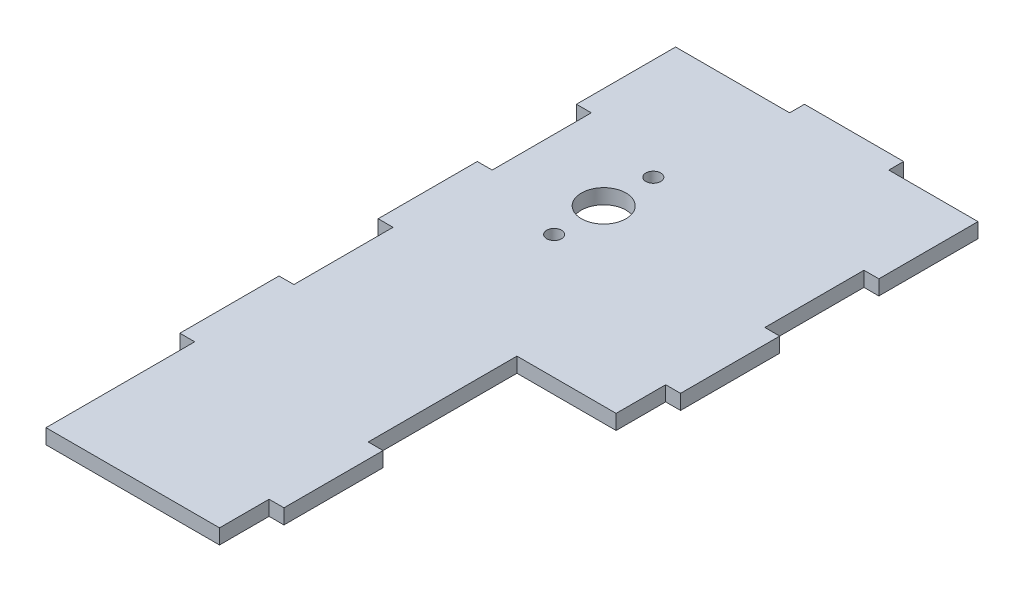
ISO-10303-21;
HEADER;
FILE_DESCRIPTION(('STEP AP214'),'2;1');
FILE_NAME('part.step','',(''),(''),'','','');
FILE_SCHEMA(('AUTOMOTIVE_DESIGN { 1 0 10303 214 1 1 1 1 }'));
ENDSEC;
DATA;
#1=APPLICATION_CONTEXT('core data for automotive mechanical design processes');
#2=APPLICATION_PROTOCOL_DEFINITION('international standard','automotive_design',2000,#1);
#3=PRODUCT_CONTEXT('',#1,'mechanical');
#4=PRODUCT('Part','Part','',(#3));
#5=PRODUCT_RELATED_PRODUCT_CATEGORY('part','',(#4));
#6=PRODUCT_DEFINITION_FORMATION('','',#4);
#7=PRODUCT_DEFINITION_CONTEXT('part definition',#1,'design');
#8=PRODUCT_DEFINITION('design','',#6,#7);
#9=PRODUCT_DEFINITION_SHAPE('','',#8);
#10=(LENGTH_UNIT() NAMED_UNIT(*) SI_UNIT(.MILLI.,.METRE.));
#11=(NAMED_UNIT(*) PLANE_ANGLE_UNIT() SI_UNIT($,.RADIAN.));
#12=(NAMED_UNIT(*) SI_UNIT($,.STERADIAN.) SOLID_ANGLE_UNIT());
#13=UNCERTAINTY_MEASURE_WITH_UNIT(LENGTH_MEASURE(1.E-05),#10,'distance_accuracy_value','');
#14=(GEOMETRIC_REPRESENTATION_CONTEXT(3) GLOBAL_UNCERTAINTY_ASSIGNED_CONTEXT((#13)) GLOBAL_UNIT_ASSIGNED_CONTEXT((#10,
#11,#12)) REPRESENTATION_CONTEXT('',''));
#15=CARTESIAN_POINT('',(0.,0.,0.));
#16=DIRECTION('',(0.,0.,1.));
#17=DIRECTION('',(1.,0.,0.));
#18=AXIS2_PLACEMENT_3D('',#15,#16,#17);
#19=CARTESIAN_POINT('',(0.,3.,0.));
#20=DIRECTION('',(1.,0.,0.));
#21=DIRECTION('',(0.,0.,-1.));
#22=AXIS2_PLACEMENT_3D('',#19,#20,#21);
#23=PLANE('',#22);
#24=DIRECTION('',(0.,0.,1.));
#25=VECTOR('',#24,1.);
#26=CARTESIAN_POINT('',(0.,3.,0.));
#27=LINE('',#26,#25);
#28=CARTESIAN_POINT('',(0.,3.,30.));
#29=VERTEX_POINT('',#28);
#30=CARTESIAN_POINT('',(0.,3.,60.));
#31=VERTEX_POINT('',#30);
#32=EDGE_CURVE('E66',#29,#31,#27,.T.);
#33=ORIENTED_EDGE('',*,*,#32,.F.);
#34=DIRECTION('',(0.,1.,0.));
#35=VECTOR('',#34,1.);
#36=CARTESIAN_POINT('',(0.,0.,30.));
#37=LINE('',#36,#35);
#38=CARTESIAN_POINT('',(0.,0.,30.));
#39=VERTEX_POINT('',#38);
#40=EDGE_CURVE('E262',#39,#29,#37,.T.);
#41=ORIENTED_EDGE('',*,*,#40,.F.);
#42=DIRECTION('',(0.,0.,1.));
#43=VECTOR('',#42,1.);
#44=CARTESIAN_POINT('',(0.,0.,0.));
#45=LINE('',#44,#43);
#46=CARTESIAN_POINT('',(0.,0.,60.));
#47=VERTEX_POINT('',#46);
#48=EDGE_CURVE('E469',#39,#47,#45,.T.);
#49=ORIENTED_EDGE('',*,*,#48,.T.);
#50=DIRECTION('',(0.,1.,0.));
#51=VECTOR('',#50,1.);
#52=CARTESIAN_POINT('',(0.,0.,60.));
#53=LINE('',#52,#51);
#54=EDGE_CURVE('E549',#47,#31,#53,.T.);
#55=ORIENTED_EDGE('',*,*,#54,.T.);
#56=EDGE_LOOP('',(#33,#41,#49,#55));
#57=FACE_BOUND('',#56,.T.);
#58=ADVANCED_FACE('F48',(#57),#23,.F.);
#59=CARTESIAN_POINT('',(35.,3.,0.));
#60=DIRECTION('',(-1.,0.,0.));
#61=DIRECTION('',(0.,0.,1.));
#62=AXIS2_PLACEMENT_3D('',#59,#60,#61);
#63=PLANE('',#62);
#64=DIRECTION('',(0.,0.,-1.));
#65=VECTOR('',#64,1.);
#66=CARTESIAN_POINT('',(35.,3.,0.));
#67=LINE('',#66,#65);
#68=CARTESIAN_POINT('',(35.,3.,30.));
#69=VERTEX_POINT('',#68);
#70=CARTESIAN_POINT('',(35.,3.,0.));
#71=VERTEX_POINT('',#70);
#72=EDGE_CURVE('E297',#69,#71,#67,.T.);
#73=ORIENTED_EDGE('',*,*,#72,.F.);
#74=DIRECTION('',(0.,1.,0.));
#75=VECTOR('',#74,1.);
#76=CARTESIAN_POINT('',(35.,0.,30.));
#77=LINE('',#76,#75);
#78=CARTESIAN_POINT('',(35.,0.,30.));
#79=VERTEX_POINT('',#78);
#80=EDGE_CURVE('E351',#79,#69,#77,.T.);
#81=ORIENTED_EDGE('',*,*,#80,.F.);
#82=DIRECTION('',(0.,0.,-1.));
#83=VECTOR('',#82,1.);
#84=CARTESIAN_POINT('',(35.,0.,0.));
#85=LINE('',#84,#83);
#86=CARTESIAN_POINT('',(35.,0.,0.));
#87=VERTEX_POINT('',#86);
#88=EDGE_CURVE('E478',#79,#87,#85,.T.);
#89=ORIENTED_EDGE('',*,*,#88,.T.);
#90=DIRECTION('',(0.,1.,0.));
#91=VECTOR('',#90,1.);
#92=CARTESIAN_POINT('',(35.,0.,0.));
#93=LINE('',#92,#91);
#94=EDGE_CURVE('E526',#87,#71,#93,.T.);
#95=ORIENTED_EDGE('',*,*,#94,.T.);
#96=EDGE_LOOP('',(#73,#81,#89,#95));
#97=FACE_BOUND('',#96,.T.);
#98=ADVANCED_FACE('F534',(#97),#63,.F.);
#99=CARTESIAN_POINT('',(0.,3.,-70.));
#100=DIRECTION('',(0.,0.,1.));
#101=DIRECTION('',(1.,0.,0.));
#102=AXIS2_PLACEMENT_3D('',#99,#100,#101);
#103=PLANE('',#102);
#104=DIRECTION('',(0.,1.,0.));
#105=VECTOR('',#104,1.);
#106=CARTESIAN_POINT('',(20.,0.,-70.));
#107=LINE('',#106,#105);
#108=CARTESIAN_POINT('',(20.,0.,-70.));
#109=VERTEX_POINT('',#108);
#110=CARTESIAN_POINT('',(20.,3.,-70.));
#111=VERTEX_POINT('',#110);
#112=EDGE_CURVE('E376',#109,#111,#107,.T.);
#113=ORIENTED_EDGE('',*,*,#112,.F.);
#114=DIRECTION('',(-1.,0.,0.));
#115=VECTOR('',#114,1.);
#116=CARTESIAN_POINT('',(0.,0.,-70.));
#117=LINE('',#116,#115);
#118=CARTESIAN_POINT('',(-3.,0.,-70.));
#119=VERTEX_POINT('',#118);
#120=EDGE_CURVE('E488',#109,#119,#117,.T.);
#121=ORIENTED_EDGE('',*,*,#120,.T.);
#122=DIRECTION('',(0.,-1.,0.));
#123=VECTOR('',#122,1.);
#124=CARTESIAN_POINT('',(-3.,3.,-70.));
#125=LINE('',#124,#123);
#126=CARTESIAN_POINT('',(-3.,3.,-70.));
#127=VERTEX_POINT('',#126);
#128=EDGE_CURVE('E445',#127,#119,#125,.T.);
#129=ORIENTED_EDGE('',*,*,#128,.F.);
#130=DIRECTION('',(-1.,0.,0.));
#131=VECTOR('',#130,1.);
#132=CARTESIAN_POINT('',(0.,3.,-70.));
#133=LINE('',#132,#131);
#134=EDGE_CURVE('E58',#111,#127,#133,.T.);
#135=ORIENTED_EDGE('',*,*,#134,.F.);
#136=EDGE_LOOP('',(#113,#121,#129,#135));
#137=FACE_BOUND('',#136,.T.);
#138=ADVANCED_FACE('F502',(#137),#103,.F.);
#139=CARTESIAN_POINT('',(55.,0.,-70.));
#140=DIRECTION('',(1.,0.,0.));
#141=DIRECTION('',(0.,0.,-1.));
#142=AXIS2_PLACEMENT_3D('',#139,#140,#141);
#143=PLANE('',#142);
#144=DIRECTION('',(0.,1.,0.));
#145=VECTOR('',#144,1.);
#146=CARTESIAN_POINT('',(55.,0.,-30.));
#147=LINE('',#146,#145);
#148=CARTESIAN_POINT('',(55.,0.,-30.));
#149=VERTEX_POINT('',#148);
#150=CARTESIAN_POINT('',(55.,3.,-30.));
#151=VERTEX_POINT('',#150);
#152=EDGE_CURVE('E676',#149,#151,#147,.T.);
#153=ORIENTED_EDGE('',*,*,#152,.F.);
#154=DIRECTION('',(0.,0.,-1.));
#155=VECTOR('',#154,1.);
#156=CARTESIAN_POINT('',(55.,0.,-70.));
#157=LINE('',#156,#155);
#158=CARTESIAN_POINT('',(55.,0.,-50.));
#159=VERTEX_POINT('',#158);
#160=EDGE_CURVE('E542',#149,#159,#157,.T.);
#161=ORIENTED_EDGE('',*,*,#160,.T.);
#162=DIRECTION('',(0.,1.,0.));
#163=VECTOR('',#162,1.);
#164=CARTESIAN_POINT('',(55.,0.,-50.));
#165=LINE('',#164,#163);
#166=CARTESIAN_POINT('',(55.,3.,-50.));
#167=VERTEX_POINT('',#166);
#168=EDGE_CURVE('E728',#159,#167,#165,.T.);
#169=ORIENTED_EDGE('',*,*,#168,.T.);
#170=DIRECTION('',(0.,0.,-1.));
#171=VECTOR('',#170,1.);
#172=CARTESIAN_POINT('',(55.,3.,-70.));
#173=LINE('',#172,#171);
#174=EDGE_CURVE('E531',#151,#167,#173,.T.);
#175=ORIENTED_EDGE('',*,*,#174,.F.);
#176=EDGE_LOOP('',(#153,#161,#169,#175));
#177=FACE_BOUND('',#176,.T.);
#178=ADVANCED_FACE('F628',(#177),#143,.T.);
#179=DIRECTION('',(0.,1.,0.));
#180=VECTOR('',#179,1.);
#181=CARTESIAN_POINT('',(55.,0.,-10.));
#182=LINE('',#181,#180);
#183=CARTESIAN_POINT('',(55.,0.,-10.));
#184=VERTEX_POINT('',#183);
#185=CARTESIAN_POINT('',(55.,3.,-10.));
#186=VERTEX_POINT('',#185);
#187=EDGE_CURVE('E686',#184,#186,#182,.T.);
#188=ORIENTED_EDGE('',*,*,#187,.T.);
#189=CARTESIAN_POINT('',(55.,3.,0.));
#190=VERTEX_POINT('',#189);
#191=EDGE_CURVE('E740',#190,#186,#173,.T.);
#192=ORIENTED_EDGE('',*,*,#191,.F.);
#193=DIRECTION('',(0.,1.,0.));
#194=VECTOR('',#193,1.);
#195=CARTESIAN_POINT('',(55.,0.,0.));
#196=LINE('',#195,#194);
#197=CARTESIAN_POINT('',(55.,0.,0.));
#198=VERTEX_POINT('',#197);
#199=EDGE_CURVE('E528',#198,#190,#196,.T.);
#200=ORIENTED_EDGE('',*,*,#199,.F.);
#201=EDGE_CURVE('E536',#198,#184,#157,.T.);
#202=ORIENTED_EDGE('',*,*,#201,.T.);
#203=EDGE_LOOP('',(#188,#192,#200,#202));
#204=FACE_BOUND('',#203,.T.);
#205=ADVANCED_FACE('F622',(#204),#143,.T.);
#206=DIRECTION('',(0.,-1.,0.));
#207=VECTOR('',#206,1.);
#208=CARTESIAN_POINT('',(0.,3.,-30.));
#209=LINE('',#208,#207);
#210=CARTESIAN_POINT('',(0.,3.,-30.));
#211=VERTEX_POINT('',#210);
#212=CARTESIAN_POINT('',(0.,0.,-30.));
#213=VERTEX_POINT('',#212);
#214=EDGE_CURVE('E425',#211,#213,#209,.T.);
#215=ORIENTED_EDGE('',*,*,#214,.F.);
#216=CARTESIAN_POINT('',(0.,3.,-50.));
#217=VERTEX_POINT('',#216);
#218=EDGE_CURVE('E291',#217,#211,#27,.T.);
#219=ORIENTED_EDGE('',*,*,#218,.F.);
#220=DIRECTION('',(0.,1.,0.));
#221=VECTOR('',#220,1.);
#222=CARTESIAN_POINT('',(0.,3.,-50.));
#223=LINE('',#222,#221);
#224=CARTESIAN_POINT('',(0.,0.,-50.));
#225=VERTEX_POINT('',#224);
#226=EDGE_CURVE('E444',#225,#217,#223,.T.);
#227=ORIENTED_EDGE('',*,*,#226,.F.);
#228=EDGE_CURVE('E392',#225,#213,#45,.T.);
#229=ORIENTED_EDGE('',*,*,#228,.T.);
#230=EDGE_LOOP('',(#215,#219,#227,#229));
#231=FACE_BOUND('',#230,.T.);
#232=ADVANCED_FACE('F50',(#231),#23,.F.);
#233=CARTESIAN_POINT('',(0.,0.,-10.));
#234=VERTEX_POINT('',#233);
#235=CARTESIAN_POINT('',(0.,0.,9.99999999999999));
#236=VERTEX_POINT('',#235);
#237=EDGE_CURVE('E474',#234,#236,#45,.T.);
#238=ORIENTED_EDGE('',*,*,#237,.T.);
#239=DIRECTION('',(0.,1.,0.));
#240=VECTOR('',#239,1.);
#241=CARTESIAN_POINT('',(0.,0.,9.99999999999999));
#242=LINE('',#241,#240);
#243=CARTESIAN_POINT('',(0.,3.,9.99999999999999));
#244=VERTEX_POINT('',#243);
#245=EDGE_CURVE('E74',#236,#244,#242,.T.);
#246=ORIENTED_EDGE('',*,*,#245,.T.);
#247=CARTESIAN_POINT('',(0.,3.,-10.));
#248=VERTEX_POINT('',#247);
#249=EDGE_CURVE('E298',#248,#244,#27,.T.);
#250=ORIENTED_EDGE('',*,*,#249,.F.);
#251=DIRECTION('',(0.,1.,0.));
#252=VECTOR('',#251,1.);
#253=CARTESIAN_POINT('',(0.,3.,-10.));
#254=LINE('',#253,#252);
#255=EDGE_CURVE('E414',#234,#248,#254,.T.);
#256=ORIENTED_EDGE('',*,*,#255,.F.);
#257=EDGE_LOOP('',(#238,#246,#250,#256));
#258=FACE_BOUND('',#257,.T.);
#259=ADVANCED_FACE('F605',(#258),#23,.F.);
#260=CARTESIAN_POINT('',(35.,0.,60.));
#261=VERTEX_POINT('',#260);
#262=CARTESIAN_POINT('',(35.,0.,50.));
#263=VERTEX_POINT('',#262);
#264=EDGE_CURVE('E482',#261,#263,#85,.T.);
#265=ORIENTED_EDGE('',*,*,#264,.T.);
#266=DIRECTION('',(0.,1.,0.));
#267=VECTOR('',#266,1.);
#268=CARTESIAN_POINT('',(35.,0.,50.));
#269=LINE('',#268,#267);
#270=CARTESIAN_POINT('',(35.,3.,50.));
#271=VERTEX_POINT('',#270);
#272=EDGE_CURVE('E334',#263,#271,#269,.T.);
#273=ORIENTED_EDGE('',*,*,#272,.T.);
#274=CARTESIAN_POINT('',(35.,3.,60.));
#275=VERTEX_POINT('',#274);
#276=EDGE_CURVE('E301',#275,#271,#67,.T.);
#277=ORIENTED_EDGE('',*,*,#276,.F.);
#278=DIRECTION('',(0.,1.,0.));
#279=VECTOR('',#278,1.);
#280=CARTESIAN_POINT('',(35.,0.,60.));
#281=LINE('',#280,#279);
#282=EDGE_CURVE('E555',#261,#275,#281,.T.);
#283=ORIENTED_EDGE('',*,*,#282,.F.);
#284=EDGE_LOOP('',(#265,#273,#277,#283));
#285=FACE_BOUND('',#284,.T.);
#286=ADVANCED_FACE('F619',(#285),#63,.F.);
#287=CARTESIAN_POINT('',(58.,0.,-70.));
#288=VERTEX_POINT('',#287);
#289=CARTESIAN_POINT('',(40.,0.,-70.));
#290=VERTEX_POINT('',#289);
#291=EDGE_CURVE('E489',#288,#290,#117,.T.);
#292=ORIENTED_EDGE('',*,*,#291,.T.);
#293=DIRECTION('',(0.,1.,0.));
#294=VECTOR('',#293,1.);
#295=CARTESIAN_POINT('',(40.,0.,-70.));
#296=LINE('',#295,#294);
#297=CARTESIAN_POINT('',(40.,3.,-70.));
#298=VERTEX_POINT('',#297);
#299=EDGE_CURVE('E667',#290,#298,#296,.T.);
#300=ORIENTED_EDGE('',*,*,#299,.T.);
#301=CARTESIAN_POINT('',(58.,3.,-70.));
#302=VERTEX_POINT('',#301);
#303=EDGE_CURVE('E12',#302,#298,#133,.T.);
#304=ORIENTED_EDGE('',*,*,#303,.F.);
#305=DIRECTION('',(0.,1.,0.));
#306=VECTOR('',#305,1.);
#307=CARTESIAN_POINT('',(58.,0.,-70.));
#308=LINE('',#307,#306);
#309=EDGE_CURVE('E532',#288,#302,#308,.T.);
#310=ORIENTED_EDGE('',*,*,#309,.F.);
#311=EDGE_LOOP('',(#292,#300,#304,#310));
#312=FACE_BOUND('',#311,.T.);
#313=ADVANCED_FACE('F643',(#312),#103,.F.);
#314=CARTESIAN_POINT('',(0.,3.,0.));
#315=DIRECTION('',(0.,-1.,0.));
#316=DIRECTION('',(0.,0.,-1.));
#317=AXIS2_PLACEMENT_3D('',#314,#315,#316);
#318=PLANE('',#317);
#319=CARTESIAN_POINT('',(17.5,3.,-45.));
#320=DIRECTION('',(0.,-1.,0.));
#321=DIRECTION('',(0.,0.,-1.));
#322=AXIS2_PLACEMENT_3D('',#319,#320,#321);
#323=CIRCLE('',#322,1.5);
#324=CARTESIAN_POINT('',(17.5,3.,-46.5));
#325=VERTEX_POINT('',#324);
#326=EDGE_CURVE('E563',#325,#325,#323,.T.);
#327=ORIENTED_EDGE('',*,*,#326,.T.);
#328=EDGE_LOOP('',(#327));
#329=FACE_BOUND('',#328,.T.);
#330=CARTESIAN_POINT('',(17.5,3.,-25.));
#331=DIRECTION('',(0.,-1.,0.));
#332=DIRECTION('',(0.,0.,-1.));
#333=AXIS2_PLACEMENT_3D('',#330,#331,#332);
#334=CIRCLE('',#333,1.5);
#335=CARTESIAN_POINT('',(17.5,3.,-26.5));
#336=VERTEX_POINT('',#335);
#337=EDGE_CURVE('E407',#336,#336,#334,.T.);
#338=ORIENTED_EDGE('',*,*,#337,.T.);
#339=EDGE_LOOP('',(#338));
#340=FACE_BOUND('',#339,.T.);
#341=CARTESIAN_POINT('',(17.5,3.,-35.));
#342=DIRECTION('',(0.,1.,0.));
#343=DIRECTION('',(0.,0.,1.));
#344=AXIS2_PLACEMENT_3D('',#341,#342,#343);
#345=CIRCLE('',#344,4.5);
#346=CARTESIAN_POINT('',(17.5,3.,-30.5));
#347=VERTEX_POINT('',#346);
#348=EDGE_CURVE('E401',#347,#347,#345,.T.);
#349=ORIENTED_EDGE('',*,*,#348,.F.);
#350=EDGE_LOOP('',(#349));
#351=FACE_BOUND('',#350,.T.);
#352=ORIENTED_EDGE('',*,*,#303,.T.);
#353=DIRECTION('',(0.,0.,-1.));
#354=VECTOR('',#353,1.);
#355=CARTESIAN_POINT('',(40.,3.,-70.));
#356=LINE('',#355,#354);
#357=CARTESIAN_POINT('',(40.,3.,-73.));
#358=VERTEX_POINT('',#357);
#359=EDGE_CURVE('E381',#298,#358,#356,.T.);
#360=ORIENTED_EDGE('',*,*,#359,.T.);
#361=DIRECTION('',(-1.,0.,0.));
#362=VECTOR('',#361,1.);
#363=CARTESIAN_POINT('',(20.,3.,-73.));
#364=LINE('',#363,#362);
#365=CARTESIAN_POINT('',(20.,3.,-73.));
#366=VERTEX_POINT('',#365);
#367=EDGE_CURVE('E368',#358,#366,#364,.T.);
#368=ORIENTED_EDGE('',*,*,#367,.T.);
#369=DIRECTION('',(0.,0.,1.));
#370=VECTOR('',#369,1.);
#371=CARTESIAN_POINT('',(20.,3.,-70.));
#372=LINE('',#371,#370);
#373=EDGE_CURVE('E355',#366,#111,#372,.T.);
#374=ORIENTED_EDGE('',*,*,#373,.T.);
#375=ORIENTED_EDGE('',*,*,#134,.T.);
#376=DIRECTION('',(0.,0.,-1.));
#377=VECTOR('',#376,1.);
#378=CARTESIAN_POINT('',(-3.,3.,-70.));
#379=LINE('',#378,#377);
#380=CARTESIAN_POINT('',(-3.,3.,-50.));
#381=VERTEX_POINT('',#380);
#382=EDGE_CURVE('E454',#381,#127,#379,.T.);
#383=ORIENTED_EDGE('',*,*,#382,.F.);
#384=DIRECTION('',(1.,0.,0.));
#385=VECTOR('',#384,1.);
#386=CARTESIAN_POINT('',(-3.,3.,-50.));
#387=LINE('',#386,#385);
#388=EDGE_CURVE('E459',#381,#217,#387,.T.);
#389=ORIENTED_EDGE('',*,*,#388,.T.);
#390=ORIENTED_EDGE('',*,*,#218,.T.);
#391=DIRECTION('',(1.,0.,0.));
#392=VECTOR('',#391,1.);
#393=CARTESIAN_POINT('',(-3.,3.,-30.));
#394=LINE('',#393,#392);
#395=CARTESIAN_POINT('',(-3.,3.,-30.));
#396=VERTEX_POINT('',#395);
#397=EDGE_CURVE('E424',#396,#211,#394,.T.);
#398=ORIENTED_EDGE('',*,*,#397,.F.);
#399=DIRECTION('',(0.,0.,-1.));
#400=VECTOR('',#399,1.);
#401=CARTESIAN_POINT('',(-3.,3.,-30.));
#402=LINE('',#401,#400);
#403=CARTESIAN_POINT('',(-3.,3.,-10.));
#404=VERTEX_POINT('',#403);
#405=EDGE_CURVE('E420',#404,#396,#402,.T.);
#406=ORIENTED_EDGE('',*,*,#405,.F.);
#407=DIRECTION('',(1.,0.,0.));
#408=VECTOR('',#407,1.);
#409=CARTESIAN_POINT('',(-3.,3.,-10.));
#410=LINE('',#409,#408);
#411=EDGE_CURVE('E431',#404,#248,#410,.T.);
#412=ORIENTED_EDGE('',*,*,#411,.T.);
#413=ORIENTED_EDGE('',*,*,#249,.T.);
#414=DIRECTION('',(-1.,0.,0.));
#415=VECTOR('',#414,1.);
#416=CARTESIAN_POINT('',(0.,3.,9.99999999999999));
#417=LINE('',#416,#415);
#418=CARTESIAN_POINT('',(-3.,3.,9.99999999999999));
#419=VERTEX_POINT('',#418);
#420=EDGE_CURVE('E269',#244,#419,#417,.T.);
#421=ORIENTED_EDGE('',*,*,#420,.T.);
#422=DIRECTION('',(0.,0.,1.));
#423=VECTOR('',#422,1.);
#424=CARTESIAN_POINT('',(-3.,3.,9.99999999999999));
#425=LINE('',#424,#423);
#426=CARTESIAN_POINT('',(-3.,3.,30.));
#427=VERTEX_POINT('',#426);
#428=EDGE_CURVE('E252',#419,#427,#425,.T.);
#429=ORIENTED_EDGE('',*,*,#428,.T.);
#430=DIRECTION('',(1.,0.,0.));
#431=VECTOR('',#430,1.);
#432=CARTESIAN_POINT('',(0.,3.,30.));
#433=LINE('',#432,#431);
#434=EDGE_CURVE('E267',#427,#29,#433,.T.);
#435=ORIENTED_EDGE('',*,*,#434,.T.);
#436=ORIENTED_EDGE('',*,*,#32,.T.);
#437=DIRECTION('',(1.,0.,0.));
#438=VECTOR('',#437,1.);
#439=CARTESIAN_POINT('',(0.,3.,60.));
#440=LINE('',#439,#438);
#441=EDGE_CURVE('E540',#31,#275,#440,.T.);
#442=ORIENTED_EDGE('',*,*,#441,.T.);
#443=ORIENTED_EDGE('',*,*,#276,.T.);
#444=DIRECTION('',(1.,0.,0.));
#445=VECTOR('',#444,1.);
#446=CARTESIAN_POINT('',(35.,3.,50.));
#447=LINE('',#446,#445);
#448=CARTESIAN_POINT('',(38.,3.,50.));
#449=VERTEX_POINT('',#448);
#450=EDGE_CURVE('E315',#271,#449,#447,.T.);
#451=ORIENTED_EDGE('',*,*,#450,.T.);
#452=DIRECTION('',(0.,0.,-1.));
#453=VECTOR('',#452,1.);
#454=CARTESIAN_POINT('',(38.,3.,50.));
#455=LINE('',#454,#453);
#456=CARTESIAN_POINT('',(38.,3.,30.));
#457=VERTEX_POINT('',#456);
#458=EDGE_CURVE('E339',#449,#457,#455,.T.);
#459=ORIENTED_EDGE('',*,*,#458,.T.);
#460=DIRECTION('',(-1.,0.,0.));
#461=VECTOR('',#460,1.);
#462=CARTESIAN_POINT('',(35.,3.,30.));
#463=LINE('',#462,#461);
#464=EDGE_CURVE('E326',#457,#69,#463,.T.);
#465=ORIENTED_EDGE('',*,*,#464,.T.);
#466=ORIENTED_EDGE('',*,*,#72,.T.);
#467=DIRECTION('',(1.,0.,0.));
#468=VECTOR('',#467,1.);
#469=CARTESIAN_POINT('',(35.,3.,0.));
#470=LINE('',#469,#468);
#471=EDGE_CURVE('E520',#71,#190,#470,.T.);
#472=ORIENTED_EDGE('',*,*,#471,.T.);
#473=ORIENTED_EDGE('',*,*,#191,.T.);
#474=DIRECTION('',(1.,0.,0.));
#475=VECTOR('',#474,1.);
#476=CARTESIAN_POINT('',(55.,3.,-10.));
#477=LINE('',#476,#475);
#478=CARTESIAN_POINT('',(58.,3.,-10.));
#479=VERTEX_POINT('',#478);
#480=EDGE_CURVE('E709',#186,#479,#477,.T.);
#481=ORIENTED_EDGE('',*,*,#480,.T.);
#482=DIRECTION('',(0.,0.,-1.));
#483=VECTOR('',#482,1.);
#484=CARTESIAN_POINT('',(58.,3.,-30.));
#485=LINE('',#484,#483);
#486=CARTESIAN_POINT('',(58.,3.,-30.));
#487=VERTEX_POINT('',#486);
#488=EDGE_CURVE('E705',#479,#487,#485,.T.);
#489=ORIENTED_EDGE('',*,*,#488,.T.);
#490=DIRECTION('',(-1.,0.,0.));
#491=VECTOR('',#490,1.);
#492=CARTESIAN_POINT('',(55.,3.,-30.));
#493=LINE('',#492,#491);
#494=EDGE_CURVE('E701',#487,#151,#493,.T.);
#495=ORIENTED_EDGE('',*,*,#494,.T.);
#496=ORIENTED_EDGE('',*,*,#174,.T.);
#497=DIRECTION('',(1.,0.,0.));
#498=VECTOR('',#497,1.);
#499=CARTESIAN_POINT('',(55.,3.,-50.));
#500=LINE('',#499,#498);
#501=CARTESIAN_POINT('',(58.,3.,-50.));
#502=VERTEX_POINT('',#501);
#503=EDGE_CURVE('E713',#167,#502,#500,.T.);
#504=ORIENTED_EDGE('',*,*,#503,.T.);
#505=DIRECTION('',(0.,0.,-1.));
#506=VECTOR('',#505,1.);
#507=CARTESIAN_POINT('',(58.,3.,-70.));
#508=LINE('',#507,#506);
#509=EDGE_CURVE('E717',#502,#302,#508,.T.);
#510=ORIENTED_EDGE('',*,*,#509,.T.);
#511=EDGE_LOOP('',(#352,#360,#368,#374,#375,#383,#389,#390,#398,#406,#412,#413,#421,#429,#435,
#436,#442,#443,#451,#459,#465,#466,#472,#473,#481,#489,#495,#496,#504,#510));
#512=FACE_BOUND('',#511,.T.);
#513=ADVANCED_FACE('F266',(#329,#340,#351,#512),#318,.F.);
#514=CARTESIAN_POINT('',(0.,0.,0.));
#515=DIRECTION('',(0.,-1.,0.));
#516=DIRECTION('',(0.,0.,-1.));
#517=AXIS2_PLACEMENT_3D('',#514,#515,#516);
#518=PLANE('',#517);
#519=CARTESIAN_POINT('',(17.5,0.,-45.));
#520=DIRECTION('',(0.,-1.,0.));
#521=DIRECTION('',(0.,0.,-1.));
#522=AXIS2_PLACEMENT_3D('',#519,#520,#521);
#523=CIRCLE('',#522,1.5);
#524=CARTESIAN_POINT('',(17.5,0.,-46.5));
#525=VERTEX_POINT('',#524);
#526=EDGE_CURVE('E559',#525,#525,#523,.T.);
#527=ORIENTED_EDGE('',*,*,#526,.F.);
#528=EDGE_LOOP('',(#527));
#529=FACE_BOUND('',#528,.T.);
#530=CARTESIAN_POINT('',(17.5,0.,-25.));
#531=DIRECTION('',(0.,-1.,0.));
#532=DIRECTION('',(0.,0.,-1.));
#533=AXIS2_PLACEMENT_3D('',#530,#531,#532);
#534=CIRCLE('',#533,1.5);
#535=CARTESIAN_POINT('',(17.5,0.,-26.5));
#536=VERTEX_POINT('',#535);
#537=EDGE_CURVE('E408',#536,#536,#534,.T.);
#538=ORIENTED_EDGE('',*,*,#537,.F.);
#539=EDGE_LOOP('',(#538));
#540=FACE_BOUND('',#539,.T.);
#541=CARTESIAN_POINT('',(17.5,0.,-35.));
#542=DIRECTION('',(0.,-1.,0.));
#543=DIRECTION('',(0.,0.,-1.));
#544=AXIS2_PLACEMENT_3D('',#541,#542,#543);
#545=CIRCLE('',#544,4.5);
#546=CARTESIAN_POINT('',(17.5,0.,-39.5));
#547=VERTEX_POINT('',#546);
#548=EDGE_CURVE('E52',#547,#547,#545,.T.);
#549=ORIENTED_EDGE('',*,*,#548,.F.);
#550=EDGE_LOOP('',(#549));
#551=FACE_BOUND('',#550,.T.);
#552=ORIENTED_EDGE('',*,*,#228,.F.);
#553=DIRECTION('',(1.,0.,0.));
#554=VECTOR('',#553,1.);
#555=CARTESIAN_POINT('',(-3.,0.,-50.));
#556=LINE('',#555,#554);
#557=CARTESIAN_POINT('',(-3.,0.,-50.));
#558=VERTEX_POINT('',#557);
#559=EDGE_CURVE('E299',#558,#225,#556,.T.);
#560=ORIENTED_EDGE('',*,*,#559,.F.);
#561=DIRECTION('',(0.,0.,1.));
#562=VECTOR('',#561,1.);
#563=CARTESIAN_POINT('',(-3.,0.,-70.));
#564=LINE('',#563,#562);
#565=EDGE_CURVE('E449',#119,#558,#564,.T.);
#566=ORIENTED_EDGE('',*,*,#565,.F.);
#567=ORIENTED_EDGE('',*,*,#120,.F.);
#568=DIRECTION('',(0.,0.,1.));
#569=VECTOR('',#568,1.);
#570=CARTESIAN_POINT('',(20.,0.,-70.));
#571=LINE('',#570,#569);
#572=CARTESIAN_POINT('',(20.,0.,-73.));
#573=VERTEX_POINT('',#572);
#574=EDGE_CURVE('E364',#573,#109,#571,.T.);
#575=ORIENTED_EDGE('',*,*,#574,.F.);
#576=DIRECTION('',(-1.,0.,0.));
#577=VECTOR('',#576,1.);
#578=CARTESIAN_POINT('',(20.,0.,-73.));
#579=LINE('',#578,#577);
#580=CARTESIAN_POINT('',(40.,0.,-73.));
#581=VERTEX_POINT('',#580);
#582=EDGE_CURVE('E372',#581,#573,#579,.T.);
#583=ORIENTED_EDGE('',*,*,#582,.F.);
#584=DIRECTION('',(0.,0.,-1.));
#585=VECTOR('',#584,1.);
#586=CARTESIAN_POINT('',(40.,0.,-70.));
#587=LINE('',#586,#585);
#588=EDGE_CURVE('E367',#290,#581,#587,.T.);
#589=ORIENTED_EDGE('',*,*,#588,.F.);
#590=ORIENTED_EDGE('',*,*,#291,.F.);
#591=DIRECTION('',(0.,0.,-1.));
#592=VECTOR('',#591,1.);
#593=CARTESIAN_POINT('',(58.,0.,-70.));
#594=LINE('',#593,#592);
#595=CARTESIAN_POINT('',(58.,0.,-50.));
#596=VERTEX_POINT('',#595);
#597=EDGE_CURVE('E724',#596,#288,#594,.T.);
#598=ORIENTED_EDGE('',*,*,#597,.F.);
#599=DIRECTION('',(1.,0.,0.));
#600=VECTOR('',#599,1.);
#601=CARTESIAN_POINT('',(55.,0.,-50.));
#602=LINE('',#601,#600);
#603=EDGE_CURVE('E721',#159,#596,#602,.T.);
#604=ORIENTED_EDGE('',*,*,#603,.F.);
#605=ORIENTED_EDGE('',*,*,#160,.F.);
#606=DIRECTION('',(-1.,0.,0.));
#607=VECTOR('',#606,1.);
#608=CARTESIAN_POINT('',(55.,0.,-30.));
#609=LINE('',#608,#607);
#610=CARTESIAN_POINT('',(58.,0.,-30.));
#611=VERTEX_POINT('',#610);
#612=EDGE_CURVE('E689',#611,#149,#609,.T.);
#613=ORIENTED_EDGE('',*,*,#612,.F.);
#614=DIRECTION('',(0.,0.,-1.));
#615=VECTOR('',#614,1.);
#616=CARTESIAN_POINT('',(58.,0.,-30.));
#617=LINE('',#616,#615);
#618=CARTESIAN_POINT('',(58.,0.,-10.));
#619=VERTEX_POINT('',#618);
#620=EDGE_CURVE('E693',#619,#611,#617,.T.);
#621=ORIENTED_EDGE('',*,*,#620,.F.);
#622=DIRECTION('',(1.,0.,0.));
#623=VECTOR('',#622,1.);
#624=CARTESIAN_POINT('',(55.,0.,-10.));
#625=LINE('',#624,#623);
#626=EDGE_CURVE('E697',#184,#619,#625,.T.);
#627=ORIENTED_EDGE('',*,*,#626,.F.);
#628=ORIENTED_EDGE('',*,*,#201,.F.);
#629=DIRECTION('',(1.,0.,0.));
#630=VECTOR('',#629,1.);
#631=CARTESIAN_POINT('',(35.,0.,0.));
#632=LINE('',#631,#630);
#633=EDGE_CURVE('E742',#87,#198,#632,.T.);
#634=ORIENTED_EDGE('',*,*,#633,.F.);
#635=ORIENTED_EDGE('',*,*,#88,.F.);
#636=DIRECTION('',(-1.,0.,0.));
#637=VECTOR('',#636,1.);
#638=CARTESIAN_POINT('',(35.,0.,30.));
#639=LINE('',#638,#637);
#640=CARTESIAN_POINT('',(38.,0.,30.));
#641=VERTEX_POINT('',#640);
#642=EDGE_CURVE('E330',#641,#79,#639,.T.);
#643=ORIENTED_EDGE('',*,*,#642,.F.);
#644=DIRECTION('',(0.,0.,-1.));
#645=VECTOR('',#644,1.);
#646=CARTESIAN_POINT('',(38.,0.,50.));
#647=LINE('',#646,#645);
#648=CARTESIAN_POINT('',(38.,0.,50.));
#649=VERTEX_POINT('',#648);
#650=EDGE_CURVE('E325',#649,#641,#647,.T.);
#651=ORIENTED_EDGE('',*,*,#650,.F.);
#652=DIRECTION('',(1.,0.,0.));
#653=VECTOR('',#652,1.);
#654=CARTESIAN_POINT('',(35.,0.,50.));
#655=LINE('',#654,#653);
#656=EDGE_CURVE('E321',#263,#649,#655,.T.);
#657=ORIENTED_EDGE('',*,*,#656,.F.);
#658=ORIENTED_EDGE('',*,*,#264,.F.);
#659=DIRECTION('',(1.,0.,0.));
#660=VECTOR('',#659,1.);
#661=CARTESIAN_POINT('',(0.,0.,60.));
#662=LINE('',#661,#660);
#663=EDGE_CURVE('E546',#47,#261,#662,.T.);
#664=ORIENTED_EDGE('',*,*,#663,.F.);
#665=ORIENTED_EDGE('',*,*,#48,.F.);
#666=DIRECTION('',(1.,0.,0.));
#667=VECTOR('',#666,1.);
#668=CARTESIAN_POINT('',(0.,0.,30.));
#669=LINE('',#668,#667);
#670=CARTESIAN_POINT('',(-3.,0.,30.));
#671=VERTEX_POINT('',#670);
#672=EDGE_CURVE('E316',#671,#39,#669,.T.);
#673=ORIENTED_EDGE('',*,*,#672,.F.);
#674=DIRECTION('',(0.,0.,1.));
#675=VECTOR('',#674,1.);
#676=CARTESIAN_POINT('',(-3.,0.,9.99999999999999));
#677=LINE('',#676,#675);
#678=CARTESIAN_POINT('',(-3.,0.,9.99999999999999));
#679=VERTEX_POINT('',#678);
#680=EDGE_CURVE('E255',#679,#671,#677,.T.);
#681=ORIENTED_EDGE('',*,*,#680,.F.);
#682=DIRECTION('',(-1.,0.,0.));
#683=VECTOR('',#682,1.);
#684=CARTESIAN_POINT('',(0.,0.,9.99999999999999));
#685=LINE('',#684,#683);
#686=EDGE_CURVE('E274',#236,#679,#685,.T.);
#687=ORIENTED_EDGE('',*,*,#686,.F.);
#688=ORIENTED_EDGE('',*,*,#237,.F.);
#689=DIRECTION('',(1.,0.,0.));
#690=VECTOR('',#689,1.);
#691=CARTESIAN_POINT('',(-3.,0.,-10.));
#692=LINE('',#691,#690);
#693=CARTESIAN_POINT('',(-3.,0.,-10.));
#694=VERTEX_POINT('',#693);
#695=EDGE_CURVE('E436',#694,#234,#692,.T.);
#696=ORIENTED_EDGE('',*,*,#695,.F.);
#697=DIRECTION('',(0.,0.,1.));
#698=VECTOR('',#697,1.);
#699=CARTESIAN_POINT('',(-3.,0.,-30.));
#700=LINE('',#699,#698);
#701=CARTESIAN_POINT('',(-3.,0.,-30.));
#702=VERTEX_POINT('',#701);
#703=EDGE_CURVE('E413',#702,#694,#700,.T.);
#704=ORIENTED_EDGE('',*,*,#703,.F.);
#705=DIRECTION('',(1.,0.,0.));
#706=VECTOR('',#705,1.);
#707=CARTESIAN_POINT('',(-3.,0.,-30.));
#708=LINE('',#707,#706);
#709=EDGE_CURVE('E440',#702,#213,#708,.T.);
#710=ORIENTED_EDGE('',*,*,#709,.T.);
#711=EDGE_LOOP('',(#552,#560,#566,#567,#575,#583,#589,#590,#598,#604,#605,#613,#621,#627,#628,
#634,#635,#643,#651,#657,#658,#664,#665,#673,#681,#687,#688,#696,#704,#710));
#712=FACE_BOUND('',#711,.T.);
#713=ADVANCED_FACE('F506',(#529,#540,#551,#712),#518,.T.);
#714=CARTESIAN_POINT('',(-3.,3.,-50.));
#715=DIRECTION('',(0.,0.,-1.));
#716=DIRECTION('',(-1.,0.,0.));
#717=AXIS2_PLACEMENT_3D('',#714,#715,#716);
#718=PLANE('',#717);
#719=ORIENTED_EDGE('',*,*,#226,.T.);
#720=ORIENTED_EDGE('',*,*,#388,.F.);
#721=DIRECTION('',(0.,1.,0.));
#722=VECTOR('',#721,1.);
#723=CARTESIAN_POINT('',(-3.,3.,-50.));
#724=LINE('',#723,#722);
#725=EDGE_CURVE('E452',#558,#381,#724,.T.);
#726=ORIENTED_EDGE('',*,*,#725,.F.);
#727=ORIENTED_EDGE('',*,*,#559,.T.);
#728=EDGE_LOOP('',(#719,#720,#726,#727));
#729=FACE_BOUND('',#728,.T.);
#730=ADVANCED_FACE('F580',(#729),#718,.F.);
#731=CARTESIAN_POINT('',(-3.,0.,0.));
#732=DIRECTION('',(-1.,0.,0.));
#733=DIRECTION('',(0.,0.,1.));
#734=AXIS2_PLACEMENT_3D('',#731,#732,#733);
#735=PLANE('',#734);
#736=ORIENTED_EDGE('',*,*,#128,.T.);
#737=ORIENTED_EDGE('',*,*,#565,.T.);
#738=ORIENTED_EDGE('',*,*,#725,.T.);
#739=ORIENTED_EDGE('',*,*,#382,.T.);
#740=EDGE_LOOP('',(#736,#737,#738,#739));
#741=FACE_BOUND('',#740,.T.);
#742=ADVANCED_FACE('F508',(#741),#735,.T.);
#743=CARTESIAN_POINT('',(-3.,3.,-30.));
#744=DIRECTION('',(0.,0.,1.));
#745=DIRECTION('',(1.,0.,0.));
#746=AXIS2_PLACEMENT_3D('',#743,#744,#745);
#747=PLANE('',#746);
#748=ORIENTED_EDGE('',*,*,#214,.T.);
#749=ORIENTED_EDGE('',*,*,#709,.F.);
#750=DIRECTION('',(0.,-1.,0.));
#751=VECTOR('',#750,1.);
#752=CARTESIAN_POINT('',(-3.,3.,-30.));
#753=LINE('',#752,#751);
#754=EDGE_CURVE('E409',#396,#702,#753,.T.);
#755=ORIENTED_EDGE('',*,*,#754,.F.);
#756=ORIENTED_EDGE('',*,*,#397,.T.);
#757=EDGE_LOOP('',(#748,#749,#755,#756));
#758=FACE_BOUND('',#757,.T.);
#759=ADVANCED_FACE('F631',(#758),#747,.F.);
#760=CARTESIAN_POINT('',(-3.,3.,-10.));
#761=DIRECTION('',(0.,0.,-1.));
#762=DIRECTION('',(-1.,0.,0.));
#763=AXIS2_PLACEMENT_3D('',#760,#761,#762);
#764=PLANE('',#763);
#765=ORIENTED_EDGE('',*,*,#255,.T.);
#766=ORIENTED_EDGE('',*,*,#411,.F.);
#767=DIRECTION('',(0.,1.,0.));
#768=VECTOR('',#767,1.);
#769=CARTESIAN_POINT('',(-3.,3.,-10.));
#770=LINE('',#769,#768);
#771=EDGE_CURVE('E417',#694,#404,#770,.T.);
#772=ORIENTED_EDGE('',*,*,#771,.F.);
#773=ORIENTED_EDGE('',*,*,#695,.T.);
#774=EDGE_LOOP('',(#765,#766,#772,#773));
#775=FACE_BOUND('',#774,.T.);
#776=ADVANCED_FACE('F596',(#775),#764,.F.);
#777=CARTESIAN_POINT('',(-3.,0.,0.));
#778=DIRECTION('',(-1.,0.,0.));
#779=DIRECTION('',(0.,0.,1.));
#780=AXIS2_PLACEMENT_3D('',#777,#778,#779);
#781=PLANE('',#780);
#782=ORIENTED_EDGE('',*,*,#754,.T.);
#783=ORIENTED_EDGE('',*,*,#703,.T.);
#784=ORIENTED_EDGE('',*,*,#771,.T.);
#785=ORIENTED_EDGE('',*,*,#405,.T.);
#786=EDGE_LOOP('',(#782,#783,#784,#785));
#787=FACE_BOUND('',#786,.T.);
#788=ADVANCED_FACE('F603',(#787),#781,.T.);
#789=CARTESIAN_POINT('',(17.5,-7.,-35.));
#790=DIRECTION('',(0.,1.,0.));
#791=DIRECTION('',(0.,0.,1.));
#792=AXIS2_PLACEMENT_3D('',#789,#790,#791);
#793=CYLINDRICAL_SURFACE('',#792,4.5);
#794=ORIENTED_EDGE('',*,*,#548,.T.);
#795=EDGE_LOOP('',(#794));
#796=FACE_BOUND('',#795,.T.);
#797=ORIENTED_EDGE('',*,*,#348,.T.);
#798=EDGE_LOOP('',(#797));
#799=FACE_BOUND('',#798,.T.);
#800=ADVANCED_FACE('F812',(#796,#799),#793,.F.);
#801=CARTESIAN_POINT('',(17.5,3.,-25.));
#802=DIRECTION('',(0.,-1.,0.));
#803=DIRECTION('',(0.,0.,-1.));
#804=AXIS2_PLACEMENT_3D('',#801,#802,#803);
#805=CYLINDRICAL_SURFACE('',#804,1.5);
#806=ORIENTED_EDGE('',*,*,#337,.F.);
#807=EDGE_LOOP('',(#806));
#808=FACE_BOUND('',#807,.T.);
#809=ORIENTED_EDGE('',*,*,#537,.T.);
#810=EDGE_LOOP('',(#809));
#811=FACE_BOUND('',#810,.T.);
#812=ADVANCED_FACE('F576',(#808,#811),#805,.F.);
#813=CARTESIAN_POINT('',(17.5,10.,-45.));
#814=DIRECTION('',(0.,-1.,0.));
#815=DIRECTION('',(0.,0.,-1.));
#816=AXIS2_PLACEMENT_3D('',#813,#814,#815);
#817=CYLINDRICAL_SURFACE('',#816,1.5);
#818=ORIENTED_EDGE('',*,*,#526,.T.);
#819=EDGE_LOOP('',(#818));
#820=FACE_BOUND('',#819,.T.);
#821=ORIENTED_EDGE('',*,*,#326,.F.);
#822=EDGE_LOOP('',(#821));
#823=FACE_BOUND('',#822,.T.);
#824=ADVANCED_FACE('F805',(#820,#823),#817,.F.);
#825=CARTESIAN_POINT('',(0.,0.,60.));
#826=DIRECTION('',(0.,0.,1.));
#827=DIRECTION('',(1.,0.,0.));
#828=AXIS2_PLACEMENT_3D('',#825,#826,#827);
#829=PLANE('',#828);
#830=ORIENTED_EDGE('',*,*,#441,.F.);
#831=ORIENTED_EDGE('',*,*,#54,.F.);
#832=ORIENTED_EDGE('',*,*,#663,.T.);
#833=ORIENTED_EDGE('',*,*,#282,.T.);
#834=EDGE_LOOP('',(#830,#831,#832,#833));
#835=FACE_BOUND('',#834,.T.);
#836=ADVANCED_FACE('F802',(#835),#829,.T.);
#837=CARTESIAN_POINT('',(35.,0.,0.));
#838=DIRECTION('',(0.,0.,1.));
#839=DIRECTION('',(1.,0.,0.));
#840=AXIS2_PLACEMENT_3D('',#837,#838,#839);
#841=PLANE('',#840);
#842=ORIENTED_EDGE('',*,*,#471,.F.);
#843=ORIENTED_EDGE('',*,*,#94,.F.);
#844=ORIENTED_EDGE('',*,*,#633,.T.);
#845=ORIENTED_EDGE('',*,*,#199,.T.);
#846=EDGE_LOOP('',(#842,#843,#844,#845));
#847=FACE_BOUND('',#846,.T.);
#848=ADVANCED_FACE('F524',(#847),#841,.T.);
#849=CARTESIAN_POINT('',(58.,0.,-70.));
#850=DIRECTION('',(1.,0.,0.));
#851=DIRECTION('',(0.,0.,-1.));
#852=AXIS2_PLACEMENT_3D('',#849,#850,#851);
#853=PLANE('',#852);
#854=ORIENTED_EDGE('',*,*,#509,.F.);
#855=DIRECTION('',(0.,1.,0.));
#856=VECTOR('',#855,1.);
#857=CARTESIAN_POINT('',(58.,0.,-50.));
#858=LINE('',#857,#856);
#859=EDGE_CURVE('E732',#596,#502,#858,.T.);
#860=ORIENTED_EDGE('',*,*,#859,.F.);
#861=ORIENTED_EDGE('',*,*,#597,.T.);
#862=ORIENTED_EDGE('',*,*,#309,.T.);
#863=EDGE_LOOP('',(#854,#860,#861,#862));
#864=FACE_BOUND('',#863,.T.);
#865=ADVANCED_FACE('F771',(#864),#853,.T.);
#866=CARTESIAN_POINT('',(55.,0.,-50.));
#867=DIRECTION('',(0.,0.,1.));
#868=DIRECTION('',(1.,0.,0.));
#869=AXIS2_PLACEMENT_3D('',#866,#867,#868);
#870=PLANE('',#869);
#871=ORIENTED_EDGE('',*,*,#503,.F.);
#872=ORIENTED_EDGE('',*,*,#168,.F.);
#873=ORIENTED_EDGE('',*,*,#603,.T.);
#874=ORIENTED_EDGE('',*,*,#859,.T.);
#875=EDGE_LOOP('',(#871,#872,#873,#874));
#876=FACE_BOUND('',#875,.T.);
#877=ADVANCED_FACE('F766',(#876),#870,.T.);
#878=CARTESIAN_POINT('',(55.,0.,-30.));
#879=DIRECTION('',(0.,0.,-1.));
#880=DIRECTION('',(-1.,0.,0.));
#881=AXIS2_PLACEMENT_3D('',#878,#879,#880);
#882=PLANE('',#881);
#883=ORIENTED_EDGE('',*,*,#494,.F.);
#884=DIRECTION('',(0.,1.,0.));
#885=VECTOR('',#884,1.);
#886=CARTESIAN_POINT('',(58.,0.,-30.));
#887=LINE('',#886,#885);
#888=EDGE_CURVE('E680',#611,#487,#887,.T.);
#889=ORIENTED_EDGE('',*,*,#888,.F.);
#890=ORIENTED_EDGE('',*,*,#612,.T.);
#891=ORIENTED_EDGE('',*,*,#152,.T.);
#892=EDGE_LOOP('',(#883,#889,#890,#891));
#893=FACE_BOUND('',#892,.T.);
#894=ADVANCED_FACE('F774',(#893),#882,.T.);
#895=CARTESIAN_POINT('',(58.,0.,-30.));
#896=DIRECTION('',(1.,0.,0.));
#897=DIRECTION('',(0.,0.,-1.));
#898=AXIS2_PLACEMENT_3D('',#895,#896,#897);
#899=PLANE('',#898);
#900=ORIENTED_EDGE('',*,*,#488,.F.);
#901=DIRECTION('',(0.,1.,0.));
#902=VECTOR('',#901,1.);
#903=CARTESIAN_POINT('',(58.,0.,-10.));
#904=LINE('',#903,#902);
#905=EDGE_CURVE('E683',#619,#479,#904,.T.);
#906=ORIENTED_EDGE('',*,*,#905,.F.);
#907=ORIENTED_EDGE('',*,*,#620,.T.);
#908=ORIENTED_EDGE('',*,*,#888,.T.);
#909=EDGE_LOOP('',(#900,#906,#907,#908));
#910=FACE_BOUND('',#909,.T.);
#911=ADVANCED_FACE('F784',(#910),#899,.T.);
#912=CARTESIAN_POINT('',(55.,0.,-10.));
#913=DIRECTION('',(0.,0.,1.));
#914=DIRECTION('',(1.,0.,0.));
#915=AXIS2_PLACEMENT_3D('',#912,#913,#914);
#916=PLANE('',#915);
#917=ORIENTED_EDGE('',*,*,#480,.F.);
#918=ORIENTED_EDGE('',*,*,#187,.F.);
#919=ORIENTED_EDGE('',*,*,#626,.T.);
#920=ORIENTED_EDGE('',*,*,#905,.T.);
#921=EDGE_LOOP('',(#917,#918,#919,#920));
#922=FACE_BOUND('',#921,.T.);
#923=ADVANCED_FACE('F782',(#922),#916,.T.);
#924=CARTESIAN_POINT('',(20.,0.,-70.));
#925=DIRECTION('',(-1.,0.,0.));
#926=DIRECTION('',(0.,0.,1.));
#927=AXIS2_PLACEMENT_3D('',#924,#925,#926);
#928=PLANE('',#927);
#929=ORIENTED_EDGE('',*,*,#373,.F.);
#930=DIRECTION('',(0.,1.,0.));
#931=VECTOR('',#930,1.);
#932=CARTESIAN_POINT('',(20.,0.,-73.));
#933=LINE('',#932,#931);
#934=EDGE_CURVE('E673',#573,#366,#933,.T.);
#935=ORIENTED_EDGE('',*,*,#934,.F.);
#936=ORIENTED_EDGE('',*,*,#574,.T.);
#937=ORIENTED_EDGE('',*,*,#112,.T.);
#938=EDGE_LOOP('',(#929,#935,#936,#937));
#939=FACE_BOUND('',#938,.T.);
#940=ADVANCED_FACE('F791',(#939),#928,.T.);
#941=CARTESIAN_POINT('',(20.,0.,-73.));
#942=DIRECTION('',(0.,0.,-1.));
#943=DIRECTION('',(-1.,0.,0.));
#944=AXIS2_PLACEMENT_3D('',#941,#942,#943);
#945=PLANE('',#944);
#946=ORIENTED_EDGE('',*,*,#367,.F.);
#947=DIRECTION('',(0.,1.,0.));
#948=VECTOR('',#947,1.);
#949=CARTESIAN_POINT('',(40.,0.,-73.));
#950=LINE('',#949,#948);
#951=EDGE_CURVE('E670',#581,#358,#950,.T.);
#952=ORIENTED_EDGE('',*,*,#951,.F.);
#953=ORIENTED_EDGE('',*,*,#582,.T.);
#954=ORIENTED_EDGE('',*,*,#934,.T.);
#955=EDGE_LOOP('',(#946,#952,#953,#954));
#956=FACE_BOUND('',#955,.T.);
#957=ADVANCED_FACE('F934',(#956),#945,.T.);
#958=CARTESIAN_POINT('',(40.,0.,-70.));
#959=DIRECTION('',(1.,0.,0.));
#960=DIRECTION('',(0.,0.,-1.));
#961=AXIS2_PLACEMENT_3D('',#958,#959,#960);
#962=PLANE('',#961);
#963=ORIENTED_EDGE('',*,*,#359,.F.);
#964=ORIENTED_EDGE('',*,*,#299,.F.);
#965=ORIENTED_EDGE('',*,*,#588,.T.);
#966=ORIENTED_EDGE('',*,*,#951,.T.);
#967=EDGE_LOOP('',(#963,#964,#965,#966));
#968=FACE_BOUND('',#967,.T.);
#969=ADVANCED_FACE('F943',(#968),#962,.T.);
#970=CARTESIAN_POINT('',(35.,0.,30.));
#971=DIRECTION('',(0.,0.,-1.));
#972=DIRECTION('',(-1.,0.,0.));
#973=AXIS2_PLACEMENT_3D('',#970,#971,#972);
#974=PLANE('',#973);
#975=ORIENTED_EDGE('',*,*,#464,.F.);
#976=DIRECTION('',(0.,1.,0.));
#977=VECTOR('',#976,1.);
#978=CARTESIAN_POINT('',(38.,0.,30.));
#979=LINE('',#978,#977);
#980=EDGE_CURVE('E356',#641,#457,#979,.T.);
#981=ORIENTED_EDGE('',*,*,#980,.F.);
#982=ORIENTED_EDGE('',*,*,#642,.T.);
#983=ORIENTED_EDGE('',*,*,#80,.T.);
#984=EDGE_LOOP('',(#975,#981,#982,#983));
#985=FACE_BOUND('',#984,.T.);
#986=ADVANCED_FACE('F952',(#985),#974,.T.);
#987=CARTESIAN_POINT('',(38.,0.,50.));
#988=DIRECTION('',(1.,0.,0.));
#989=DIRECTION('',(0.,0.,-1.));
#990=AXIS2_PLACEMENT_3D('',#987,#988,#989);
#991=PLANE('',#990);
#992=ORIENTED_EDGE('',*,*,#458,.F.);
#993=DIRECTION('',(0.,1.,0.));
#994=VECTOR('',#993,1.);
#995=CARTESIAN_POINT('',(38.,0.,50.));
#996=LINE('',#995,#994);
#997=EDGE_CURVE('E359',#649,#449,#996,.T.);
#998=ORIENTED_EDGE('',*,*,#997,.F.);
#999=ORIENTED_EDGE('',*,*,#650,.T.);
#1000=ORIENTED_EDGE('',*,*,#980,.T.);
#1001=EDGE_LOOP('',(#992,#998,#999,#1000));
#1002=FACE_BOUND('',#1001,.T.);
#1003=ADVANCED_FACE('F660',(#1002),#991,.T.);
#1004=CARTESIAN_POINT('',(35.,0.,50.));
#1005=DIRECTION('',(0.,0.,1.));
#1006=DIRECTION('',(1.,0.,0.));
#1007=AXIS2_PLACEMENT_3D('',#1004,#1005,#1006);
#1008=PLANE('',#1007);
#1009=ORIENTED_EDGE('',*,*,#450,.F.);
#1010=ORIENTED_EDGE('',*,*,#272,.F.);
#1011=ORIENTED_EDGE('',*,*,#656,.T.);
#1012=ORIENTED_EDGE('',*,*,#997,.T.);
#1013=EDGE_LOOP('',(#1009,#1010,#1011,#1012));
#1014=FACE_BOUND('',#1013,.T.);
#1015=ADVANCED_FACE('F655',(#1014),#1008,.T.);
#1016=CARTESIAN_POINT('',(0.,0.,30.));
#1017=DIRECTION('',(0.,0.,1.));
#1018=DIRECTION('',(1.,0.,0.));
#1019=AXIS2_PLACEMENT_3D('',#1016,#1017,#1018);
#1020=PLANE('',#1019);
#1021=ORIENTED_EDGE('',*,*,#434,.F.);
#1022=DIRECTION('',(0.,1.,0.));
#1023=VECTOR('',#1022,1.);
#1024=CARTESIAN_POINT('',(-3.,0.,30.));
#1025=LINE('',#1024,#1023);
#1026=EDGE_CURVE('E249',#671,#427,#1025,.T.);
#1027=ORIENTED_EDGE('',*,*,#1026,.F.);
#1028=ORIENTED_EDGE('',*,*,#672,.T.);
#1029=ORIENTED_EDGE('',*,*,#40,.T.);
#1030=EDGE_LOOP('',(#1021,#1027,#1028,#1029));
#1031=FACE_BOUND('',#1030,.T.);
#1032=ADVANCED_FACE('F272',(#1031),#1020,.T.);
#1033=CARTESIAN_POINT('',(-3.,0.,9.99999999999999));
#1034=DIRECTION('',(-1.,0.,0.));
#1035=DIRECTION('',(0.,0.,1.));
#1036=AXIS2_PLACEMENT_3D('',#1033,#1034,#1035);
#1037=PLANE('',#1036);
#1038=ORIENTED_EDGE('',*,*,#428,.F.);
#1039=DIRECTION('',(0.,1.,0.));
#1040=VECTOR('',#1039,1.);
#1041=CARTESIAN_POINT('',(-3.,0.,9.99999999999999));
#1042=LINE('',#1041,#1040);
#1043=EDGE_CURVE('E261',#679,#419,#1042,.T.);
#1044=ORIENTED_EDGE('',*,*,#1043,.F.);
#1045=ORIENTED_EDGE('',*,*,#680,.T.);
#1046=ORIENTED_EDGE('',*,*,#1026,.T.);
#1047=EDGE_LOOP('',(#1038,#1044,#1045,#1046));
#1048=FACE_BOUND('',#1047,.T.);
#1049=ADVANCED_FACE('F251',(#1048),#1037,.T.);
#1050=CARTESIAN_POINT('',(0.,0.,9.99999999999999));
#1051=DIRECTION('',(0.,0.,-1.));
#1052=DIRECTION('',(-1.,0.,0.));
#1053=AXIS2_PLACEMENT_3D('',#1050,#1051,#1052);
#1054=PLANE('',#1053);
#1055=ORIENTED_EDGE('',*,*,#420,.F.);
#1056=ORIENTED_EDGE('',*,*,#245,.F.);
#1057=ORIENTED_EDGE('',*,*,#686,.T.);
#1058=ORIENTED_EDGE('',*,*,#1043,.T.);
#1059=EDGE_LOOP('',(#1055,#1056,#1057,#1058));
#1060=FACE_BOUND('',#1059,.T.);
#1061=ADVANCED_FACE('F607',(#1060),#1054,.T.);
#1062=CLOSED_SHELL('',(#58,#98,#138,#178,#205,#232,#259,#286,#313,#513,#713,#730,#742,#759,#776,
#788,#800,#812,#824,#836,#848,#865,#877,#894,#911,#923,#940,#957,#969,#986,#1003,#1015,#1032,
#1049,#1061));
#1063=MANIFOLD_SOLID_BREP('B2',#1062);
#1064=ADVANCED_BREP_SHAPE_REPRESENTATION('',(#18,#1063),#14);
#1065=SHAPE_DEFINITION_REPRESENTATION(#9,#1064);
ENDSEC;
END-ISO-10303-21;
